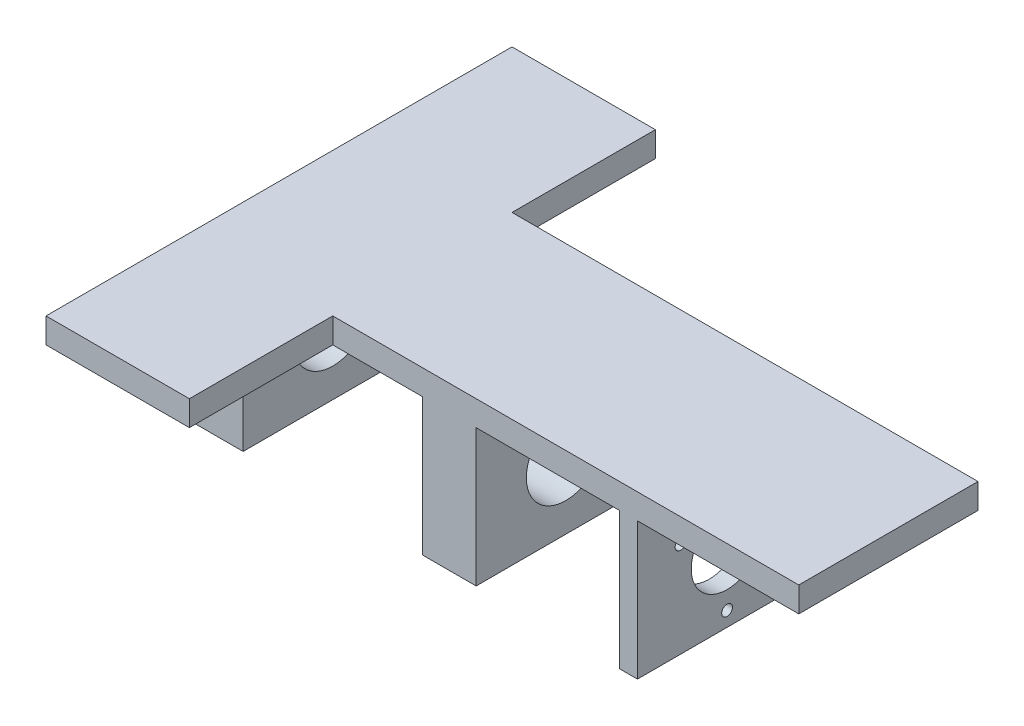
ISO-10303-21;
HEADER;
FILE_DESCRIPTION(('STEP AP214'),'2;1');
FILE_NAME('part.step','',(''),(''),'','','');
FILE_SCHEMA(('AUTOMOTIVE_DESIGN { 1 0 10303 214 1 1 1 1 }'));
ENDSEC;
DATA;
#1=APPLICATION_CONTEXT('core data for automotive mechanical design processes');
#2=APPLICATION_PROTOCOL_DEFINITION('international standard','automotive_design',2000,#1);
#3=PRODUCT_CONTEXT('',#1,'mechanical');
#4=PRODUCT('Part','Part','',(#3));
#5=PRODUCT_RELATED_PRODUCT_CATEGORY('part','',(#4));
#6=PRODUCT_DEFINITION_FORMATION('','',#4);
#7=PRODUCT_DEFINITION_CONTEXT('part definition',#1,'design');
#8=PRODUCT_DEFINITION('design','',#6,#7);
#9=PRODUCT_DEFINITION_SHAPE('','',#8);
#10=(LENGTH_UNIT() NAMED_UNIT(*) SI_UNIT(.MILLI.,.METRE.));
#11=(NAMED_UNIT(*) PLANE_ANGLE_UNIT() SI_UNIT($,.RADIAN.));
#12=(NAMED_UNIT(*) SI_UNIT($,.STERADIAN.) SOLID_ANGLE_UNIT());
#13=UNCERTAINTY_MEASURE_WITH_UNIT(LENGTH_MEASURE(1.E-05),#10,'distance_accuracy_value','');
#14=(GEOMETRIC_REPRESENTATION_CONTEXT(3) GLOBAL_UNCERTAINTY_ASSIGNED_CONTEXT((#13)) GLOBAL_UNIT_ASSIGNED_CONTEXT((#10,
#11,#12)) REPRESENTATION_CONTEXT('',''));
#15=CARTESIAN_POINT('',(0.,0.,0.));
#16=DIRECTION('',(0.,0.,1.));
#17=DIRECTION('',(1.,0.,0.));
#18=AXIS2_PLACEMENT_3D('',#15,#16,#17);
#19=CARTESIAN_POINT('',(0.,0.,40.));
#20=DIRECTION('',(0.,1.,0.));
#21=DIRECTION('',(0.,0.,1.));
#22=AXIS2_PLACEMENT_3D('',#19,#20,#21);
#23=PLANE('',#22);
#24=DIRECTION('',(0.,0.,-1.));
#25=VECTOR('',#24,1.);
#26=CARTESIAN_POINT('',(120.,0.,0.));
#27=LINE('',#26,#25);
#28=CARTESIAN_POINT('',(120.,0.,0.));
#29=VERTEX_POINT('',#28);
#30=CARTESIAN_POINT('',(120.,0.,-50.));
#31=VERTEX_POINT('',#30);
#32=EDGE_CURVE('E48',#29,#31,#27,.T.);
#33=ORIENTED_EDGE('',*,*,#32,.F.);
#34=DIRECTION('',(1.,0.,0.));
#35=VECTOR('',#34,1.);
#36=CARTESIAN_POINT('',(40.,0.,0.));
#37=LINE('',#36,#35);
#38=CARTESIAN_POINT('',(80.,0.,0.));
#39=VERTEX_POINT('',#38);
#40=EDGE_CURVE('E287',#39,#29,#37,.T.);
#41=ORIENTED_EDGE('',*,*,#40,.F.);
#42=DIRECTION('',(0.,0.,1.));
#43=VECTOR('',#42,1.);
#44=CARTESIAN_POINT('',(80.,0.,0.));
#45=LINE('',#44,#43);
#46=CARTESIAN_POINT('',(80.,0.,-50.));
#47=VERTEX_POINT('',#46);
#48=EDGE_CURVE('E192',#47,#39,#45,.T.);
#49=ORIENTED_EDGE('',*,*,#48,.F.);
#50=DIRECTION('',(-1.,0.,0.));
#51=VECTOR('',#50,1.);
#52=CARTESIAN_POINT('',(40.,0.,-50.));
#53=LINE('',#52,#51);
#54=EDGE_CURVE('E293',#31,#47,#53,.T.);
#55=ORIENTED_EDGE('',*,*,#54,.F.);
#56=EDGE_LOOP('',(#33,#41,#49,#55));
#57=FACE_BOUND('',#56,.T.);
#58=ADVANCED_FACE('F31',(#57),#23,.F.);
#59=DIRECTION('',(0.,0.,1.));
#60=VECTOR('',#59,1.);
#61=CARTESIAN_POINT('',(125.,0.,0.));
#62=LINE('',#61,#60);
#63=CARTESIAN_POINT('',(125.,0.,-50.));
#64=VERTEX_POINT('',#63);
#65=CARTESIAN_POINT('',(125.,0.,0.));
#66=VERTEX_POINT('',#65);
#67=EDGE_CURVE('E188',#64,#66,#62,.T.);
#68=ORIENTED_EDGE('',*,*,#67,.F.);
#69=CARTESIAN_POINT('',(170.,0.,-50.));
#70=VERTEX_POINT('',#69);
#71=EDGE_CURVE('E290',#70,#64,#53,.T.);
#72=ORIENTED_EDGE('',*,*,#71,.F.);
#73=DIRECTION('',(0.,0.,-1.));
#74=VECTOR('',#73,1.);
#75=CARTESIAN_POINT('',(170.,0.,0.));
#76=LINE('',#75,#74);
#77=CARTESIAN_POINT('',(170.,0.,0.));
#78=VERTEX_POINT('',#77);
#79=EDGE_CURVE('E286',#78,#70,#76,.T.);
#80=ORIENTED_EDGE('',*,*,#79,.F.);
#81=EDGE_CURVE('E282',#66,#78,#37,.T.);
#82=ORIENTED_EDGE('',*,*,#81,.F.);
#83=EDGE_LOOP('',(#68,#72,#80,#82));
#84=FACE_BOUND('',#83,.T.);
#85=ADVANCED_FACE('F359',(#84),#23,.F.);
#86=DIRECTION('',(0.,0.,-1.));
#87=VECTOR('',#86,1.);
#88=CARTESIAN_POINT('',(65.,0.,0.));
#89=LINE('',#88,#87);
#90=CARTESIAN_POINT('',(65.,0.,0.));
#91=VERTEX_POINT('',#90);
#92=CARTESIAN_POINT('',(65.,0.,-50.));
#93=VERTEX_POINT('',#92);
#94=EDGE_CURVE('E56',#91,#93,#89,.T.);
#95=ORIENTED_EDGE('',*,*,#94,.F.);
#96=CARTESIAN_POINT('',(40.,0.,0.));
#97=VERTEX_POINT('',#96);
#98=EDGE_CURVE('E283',#97,#91,#37,.T.);
#99=ORIENTED_EDGE('',*,*,#98,.F.);
#100=DIRECTION('',(0.,0.,-1.));
#101=VECTOR('',#100,1.);
#102=CARTESIAN_POINT('',(40.,0.,40.));
#103=LINE('',#102,#101);
#104=CARTESIAN_POINT('',(40.,0.,40.));
#105=VERTEX_POINT('',#104);
#106=EDGE_CURVE('E280',#105,#97,#103,.T.);
#107=ORIENTED_EDGE('',*,*,#106,.F.);
#108=DIRECTION('',(1.,0.,0.));
#109=VECTOR('',#108,1.);
#110=CARTESIAN_POINT('',(0.,0.,40.));
#111=LINE('',#110,#109);
#112=CARTESIAN_POINT('',(0.,0.,40.));
#113=VERTEX_POINT('',#112);
#114=EDGE_CURVE('E257',#113,#105,#111,.T.);
#115=ORIENTED_EDGE('',*,*,#114,.F.);
#116=DIRECTION('',(0.,0.,1.));
#117=VECTOR('',#116,1.);
#118=CARTESIAN_POINT('',(0.,0.,0.));
#119=LINE('',#118,#117);
#120=CARTESIAN_POINT('',(0.,0.,0.));
#121=VERTEX_POINT('',#120);
#122=EDGE_CURVE('E298',#121,#113,#119,.T.);
#123=ORIENTED_EDGE('',*,*,#122,.F.);
#124=DIRECTION('',(-1.,0.,0.));
#125=VECTOR('',#124,1.);
#126=CARTESIAN_POINT('',(0.,0.,0.));
#127=LINE('',#126,#125);
#128=CARTESIAN_POINT('',(15.,0.,0.));
#129=VERTEX_POINT('',#128);
#130=EDGE_CURVE('E223',#129,#121,#127,.T.);
#131=ORIENTED_EDGE('',*,*,#130,.F.);
#132=DIRECTION('',(0.,0.,1.));
#133=VECTOR('',#132,1.);
#134=CARTESIAN_POINT('',(15.,0.,0.));
#135=LINE('',#134,#133);
#136=CARTESIAN_POINT('',(15.,0.,-50.));
#137=VERTEX_POINT('',#136);
#138=EDGE_CURVE('E230',#137,#129,#135,.T.);
#139=ORIENTED_EDGE('',*,*,#138,.F.);
#140=DIRECTION('',(1.,0.,0.));
#141=VECTOR('',#140,1.);
#142=CARTESIAN_POINT('',(0.,0.,-50.));
#143=LINE('',#142,#141);
#144=CARTESIAN_POINT('',(0.,0.,-50.));
#145=VERTEX_POINT('',#144);
#146=EDGE_CURVE('E218',#145,#137,#143,.T.);
#147=ORIENTED_EDGE('',*,*,#146,.F.);
#148=CARTESIAN_POINT('',(0.,0.,-90.));
#149=VERTEX_POINT('',#148);
#150=EDGE_CURVE('E263',#149,#145,#119,.T.);
#151=ORIENTED_EDGE('',*,*,#150,.F.);
#152=DIRECTION('',(-1.,0.,0.));
#153=VECTOR('',#152,1.);
#154=CARTESIAN_POINT('',(0.,0.,-90.));
#155=LINE('',#154,#153);
#156=CARTESIAN_POINT('',(40.,0.,-90.));
#157=VERTEX_POINT('',#156);
#158=EDGE_CURVE('E295',#157,#149,#155,.T.);
#159=ORIENTED_EDGE('',*,*,#158,.F.);
#160=DIRECTION('',(0.,0.,-1.));
#161=VECTOR('',#160,1.);
#162=CARTESIAN_POINT('',(40.,0.,-90.));
#163=LINE('',#162,#161);
#164=CARTESIAN_POINT('',(40.,0.,-50.));
#165=VERTEX_POINT('',#164);
#166=EDGE_CURVE('E292',#165,#157,#163,.T.);
#167=ORIENTED_EDGE('',*,*,#166,.F.);
#168=EDGE_CURVE('E289',#93,#165,#53,.T.);
#169=ORIENTED_EDGE('',*,*,#168,.F.);
#170=EDGE_LOOP('',(#95,#99,#107,#115,#123,#131,#139,#147,#151,#159,#167,#169));
#171=FACE_BOUND('',#170,.T.);
#172=ADVANCED_FACE('F335',(#171),#23,.F.);
#173=CARTESIAN_POINT('',(0.,7.,40.));
#174=DIRECTION('',(0.,0.,-1.));
#175=DIRECTION('',(-1.,0.,0.));
#176=AXIS2_PLACEMENT_3D('',#173,#174,#175);
#177=PLANE('',#176);
#178=ORIENTED_EDGE('',*,*,#114,.T.);
#179=DIRECTION('',(0.,-1.,0.));
#180=VECTOR('',#179,1.);
#181=CARTESIAN_POINT('',(40.,7.,40.));
#182=LINE('',#181,#180);
#183=CARTESIAN_POINT('',(40.,7.,40.));
#184=VERTEX_POINT('',#183);
#185=EDGE_CURVE('E40',#184,#105,#182,.T.);
#186=ORIENTED_EDGE('',*,*,#185,.F.);
#187=DIRECTION('',(1.,0.,0.));
#188=VECTOR('',#187,1.);
#189=CARTESIAN_POINT('',(0.,7.,40.));
#190=LINE('',#189,#188);
#191=CARTESIAN_POINT('',(0.,7.,40.));
#192=VERTEX_POINT('',#191);
#193=EDGE_CURVE('E262',#192,#184,#190,.T.);
#194=ORIENTED_EDGE('',*,*,#193,.F.);
#195=DIRECTION('',(0.,-1.,0.));
#196=VECTOR('',#195,1.);
#197=CARTESIAN_POINT('',(0.,7.,40.));
#198=LINE('',#197,#196);
#199=EDGE_CURVE('E11',#192,#113,#198,.T.);
#200=ORIENTED_EDGE('',*,*,#199,.T.);
#201=EDGE_LOOP('',(#178,#186,#194,#200));
#202=FACE_BOUND('',#201,.T.);
#203=ADVANCED_FACE('F33',(#202),#177,.F.);
#204=CARTESIAN_POINT('',(40.,7.,40.));
#205=DIRECTION('',(-1.,0.,0.));
#206=DIRECTION('',(0.,0.,1.));
#207=AXIS2_PLACEMENT_3D('',#204,#205,#206);
#208=PLANE('',#207);
#209=ORIENTED_EDGE('',*,*,#106,.T.);
#210=DIRECTION('',(0.,-1.,0.));
#211=VECTOR('',#210,1.);
#212=CARTESIAN_POINT('',(40.,7.,0.));
#213=LINE('',#212,#211);
#214=CARTESIAN_POINT('',(40.,7.,0.));
#215=VERTEX_POINT('',#214);
#216=EDGE_CURVE('E310',#215,#97,#213,.T.);
#217=ORIENTED_EDGE('',*,*,#216,.F.);
#218=DIRECTION('',(0.,0.,-1.));
#219=VECTOR('',#218,1.);
#220=CARTESIAN_POINT('',(40.,7.,40.));
#221=LINE('',#220,#219);
#222=EDGE_CURVE('E265',#184,#215,#221,.T.);
#223=ORIENTED_EDGE('',*,*,#222,.F.);
#224=ORIENTED_EDGE('',*,*,#185,.T.);
#225=EDGE_LOOP('',(#209,#217,#223,#224));
#226=FACE_BOUND('',#225,.T.);
#227=ADVANCED_FACE('F372',(#226),#208,.F.);
#228=CARTESIAN_POINT('',(40.,7.,0.));
#229=DIRECTION('',(0.,0.,-1.));
#230=DIRECTION('',(-1.,0.,0.));
#231=AXIS2_PLACEMENT_3D('',#228,#229,#230);
#232=PLANE('',#231);
#233=ORIENTED_EDGE('',*,*,#98,.T.);
#234=DIRECTION('',(0.,1.,0.));
#235=VECTOR('',#234,1.);
#236=CARTESIAN_POINT('',(65.,-38.25,0.));
#237=LINE('',#236,#235);
#238=CARTESIAN_POINT('',(65.,-38.25,0.));
#239=VERTEX_POINT('',#238);
#240=EDGE_CURVE('E206',#239,#91,#237,.T.);
#241=ORIENTED_EDGE('',*,*,#240,.F.);
#242=DIRECTION('',(-1.,0.,0.));
#243=VECTOR('',#242,1.);
#244=CARTESIAN_POINT('',(65.,-38.25,0.));
#245=LINE('',#244,#243);
#246=CARTESIAN_POINT('',(80.,-38.25,0.));
#247=VERTEX_POINT('',#246);
#248=EDGE_CURVE('E205',#247,#239,#245,.T.);
#249=ORIENTED_EDGE('',*,*,#248,.F.);
#250=DIRECTION('',(0.,1.,0.));
#251=VECTOR('',#250,1.);
#252=CARTESIAN_POINT('',(80.,-38.25,0.));
#253=LINE('',#252,#251);
#254=EDGE_CURVE('E210',#247,#39,#253,.T.);
#255=ORIENTED_EDGE('',*,*,#254,.T.);
#256=ORIENTED_EDGE('',*,*,#40,.T.);
#257=DIRECTION('',(0.,1.,0.));
#258=VECTOR('',#257,1.);
#259=CARTESIAN_POINT('',(120.,-38.25,0.));
#260=LINE('',#259,#258);
#261=CARTESIAN_POINT('',(120.,-38.25,0.));
#262=VERTEX_POINT('',#261);
#263=EDGE_CURVE('E420',#262,#29,#260,.T.);
#264=ORIENTED_EDGE('',*,*,#263,.F.);
#265=DIRECTION('',(-1.,0.,0.));
#266=VECTOR('',#265,1.);
#267=CARTESIAN_POINT('',(120.,-38.25,0.));
#268=LINE('',#267,#266);
#269=CARTESIAN_POINT('',(125.,-38.25,0.));
#270=VERTEX_POINT('',#269);
#271=EDGE_CURVE('E186',#270,#262,#268,.T.);
#272=ORIENTED_EDGE('',*,*,#271,.F.);
#273=DIRECTION('',(0.,1.,0.));
#274=VECTOR('',#273,1.);
#275=CARTESIAN_POINT('',(125.,-38.25,0.));
#276=LINE('',#275,#274);
#277=EDGE_CURVE('E194',#270,#66,#276,.T.);
#278=ORIENTED_EDGE('',*,*,#277,.T.);
#279=ORIENTED_EDGE('',*,*,#81,.T.);
#280=DIRECTION('',(0.,-1.,0.));
#281=VECTOR('',#280,1.);
#282=CARTESIAN_POINT('',(170.,7.,0.));
#283=LINE('',#282,#281);
#284=CARTESIAN_POINT('',(170.,7.,0.));
#285=VERTEX_POINT('',#284);
#286=EDGE_CURVE('E313',#285,#78,#283,.T.);
#287=ORIENTED_EDGE('',*,*,#286,.F.);
#288=DIRECTION('',(1.,0.,0.));
#289=VECTOR('',#288,1.);
#290=CARTESIAN_POINT('',(40.,7.,0.));
#291=LINE('',#290,#289);
#292=EDGE_CURVE('E267',#215,#285,#291,.T.);
#293=ORIENTED_EDGE('',*,*,#292,.F.);
#294=ORIENTED_EDGE('',*,*,#216,.T.);
#295=EDGE_LOOP('',(#233,#241,#249,#255,#256,#264,#272,#278,#279,#287,#293,#294));
#296=FACE_BOUND('',#295,.T.);
#297=ADVANCED_FACE('F377',(#296),#232,.F.);
#298=CARTESIAN_POINT('',(170.,7.,0.));
#299=DIRECTION('',(-1.,0.,0.));
#300=DIRECTION('',(0.,0.,1.));
#301=AXIS2_PLACEMENT_3D('',#298,#299,#300);
#302=PLANE('',#301);
#303=ORIENTED_EDGE('',*,*,#79,.T.);
#304=DIRECTION('',(0.,-1.,0.));
#305=VECTOR('',#304,1.);
#306=CARTESIAN_POINT('',(170.,7.,-50.));
#307=LINE('',#306,#305);
#308=CARTESIAN_POINT('',(170.,7.,-50.));
#309=VERTEX_POINT('',#308);
#310=EDGE_CURVE('E316',#309,#70,#307,.T.);
#311=ORIENTED_EDGE('',*,*,#310,.F.);
#312=DIRECTION('',(0.,0.,-1.));
#313=VECTOR('',#312,1.);
#314=CARTESIAN_POINT('',(170.,7.,0.));
#315=LINE('',#314,#313);
#316=EDGE_CURVE('E269',#285,#309,#315,.T.);
#317=ORIENTED_EDGE('',*,*,#316,.F.);
#318=ORIENTED_EDGE('',*,*,#286,.T.);
#319=EDGE_LOOP('',(#303,#311,#317,#318));
#320=FACE_BOUND('',#319,.T.);
#321=ADVANCED_FACE('F412',(#320),#302,.F.);
#322=CARTESIAN_POINT('',(40.,7.,-50.));
#323=DIRECTION('',(0.,0.,1.));
#324=DIRECTION('',(1.,0.,0.));
#325=AXIS2_PLACEMENT_3D('',#322,#323,#324);
#326=PLANE('',#325);
#327=ORIENTED_EDGE('',*,*,#71,.T.);
#328=DIRECTION('',(0.,1.,0.));
#329=VECTOR('',#328,1.);
#330=CARTESIAN_POINT('',(125.,-38.25,-50.));
#331=LINE('',#330,#329);
#332=CARTESIAN_POINT('',(125.,-38.25,-50.));
#333=VERTEX_POINT('',#332);
#334=EDGE_CURVE('E177',#333,#64,#331,.T.);
#335=ORIENTED_EDGE('',*,*,#334,.F.);
#336=DIRECTION('',(1.,0.,0.));
#337=VECTOR('',#336,1.);
#338=CARTESIAN_POINT('',(120.,-38.25,-50.));
#339=LINE('',#338,#337);
#340=CARTESIAN_POINT('',(120.,-38.25,-50.));
#341=VERTEX_POINT('',#340);
#342=EDGE_CURVE('E171',#341,#333,#339,.T.);
#343=ORIENTED_EDGE('',*,*,#342,.F.);
#344=DIRECTION('',(0.,1.,0.));
#345=VECTOR('',#344,1.);
#346=CARTESIAN_POINT('',(120.,-38.25,-50.));
#347=LINE('',#346,#345);
#348=EDGE_CURVE('E175',#341,#31,#347,.T.);
#349=ORIENTED_EDGE('',*,*,#348,.T.);
#350=ORIENTED_EDGE('',*,*,#54,.T.);
#351=DIRECTION('',(0.,1.,0.));
#352=VECTOR('',#351,1.);
#353=CARTESIAN_POINT('',(80.,-38.25,-50.));
#354=LINE('',#353,#352);
#355=CARTESIAN_POINT('',(80.,-38.25,-50.));
#356=VERTEX_POINT('',#355);
#357=EDGE_CURVE('E213',#356,#47,#354,.T.);
#358=ORIENTED_EDGE('',*,*,#357,.F.);
#359=DIRECTION('',(1.,0.,0.));
#360=VECTOR('',#359,1.);
#361=CARTESIAN_POINT('',(65.,-38.25,-50.));
#362=LINE('',#361,#360);
#363=CARTESIAN_POINT('',(65.,-38.25,-50.));
#364=VERTEX_POINT('',#363);
#365=EDGE_CURVE('E201',#364,#356,#362,.T.);
#366=ORIENTED_EDGE('',*,*,#365,.F.);
#367=DIRECTION('',(0.,1.,0.));
#368=VECTOR('',#367,1.);
#369=CARTESIAN_POINT('',(65.,-38.25,-50.));
#370=LINE('',#369,#368);
#371=EDGE_CURVE('E216',#364,#93,#370,.T.);
#372=ORIENTED_EDGE('',*,*,#371,.T.);
#373=ORIENTED_EDGE('',*,*,#168,.T.);
#374=DIRECTION('',(0.,-1.,0.));
#375=VECTOR('',#374,1.);
#376=CARTESIAN_POINT('',(40.,7.,-50.));
#377=LINE('',#376,#375);
#378=CARTESIAN_POINT('',(40.,7.,-50.));
#379=VERTEX_POINT('',#378);
#380=EDGE_CURVE('E319',#379,#165,#377,.T.);
#381=ORIENTED_EDGE('',*,*,#380,.F.);
#382=DIRECTION('',(-1.,0.,0.));
#383=VECTOR('',#382,1.);
#384=CARTESIAN_POINT('',(40.,7.,-50.));
#385=LINE('',#384,#383);
#386=EDGE_CURVE('E271',#309,#379,#385,.T.);
#387=ORIENTED_EDGE('',*,*,#386,.F.);
#388=ORIENTED_EDGE('',*,*,#310,.T.);
#389=EDGE_LOOP('',(#327,#335,#343,#349,#350,#358,#366,#372,#373,#381,#387,#388));
#390=FACE_BOUND('',#389,.T.);
#391=ADVANCED_FACE('F174',(#390),#326,.F.);
#392=CARTESIAN_POINT('',(40.,7.,-90.));
#393=DIRECTION('',(-1.,0.,0.));
#394=DIRECTION('',(0.,0.,1.));
#395=AXIS2_PLACEMENT_3D('',#392,#393,#394);
#396=PLANE('',#395);
#397=ORIENTED_EDGE('',*,*,#166,.T.);
#398=DIRECTION('',(0.,-1.,0.));
#399=VECTOR('',#398,1.);
#400=CARTESIAN_POINT('',(40.,7.,-90.));
#401=LINE('',#400,#399);
#402=CARTESIAN_POINT('',(40.,7.,-90.));
#403=VERTEX_POINT('',#402);
#404=EDGE_CURVE('E321',#403,#157,#401,.T.);
#405=ORIENTED_EDGE('',*,*,#404,.F.);
#406=DIRECTION('',(0.,0.,-1.));
#407=VECTOR('',#406,1.);
#408=CARTESIAN_POINT('',(40.,7.,-90.));
#409=LINE('',#408,#407);
#410=EDGE_CURVE('E273',#379,#403,#409,.T.);
#411=ORIENTED_EDGE('',*,*,#410,.F.);
#412=ORIENTED_EDGE('',*,*,#380,.T.);
#413=EDGE_LOOP('',(#397,#405,#411,#412));
#414=FACE_BOUND('',#413,.T.);
#415=ADVANCED_FACE('F397',(#414),#396,.F.);
#416=CARTESIAN_POINT('',(0.,7.,-90.));
#417=DIRECTION('',(0.,0.,1.));
#418=DIRECTION('',(1.,0.,0.));
#419=AXIS2_PLACEMENT_3D('',#416,#417,#418);
#420=PLANE('',#419);
#421=ORIENTED_EDGE('',*,*,#158,.T.);
#422=DIRECTION('',(0.,-1.,0.));
#423=VECTOR('',#422,1.);
#424=CARTESIAN_POINT('',(0.,7.,-90.));
#425=LINE('',#424,#423);
#426=CARTESIAN_POINT('',(0.,7.,-90.));
#427=VERTEX_POINT('',#426);
#428=EDGE_CURVE('E278',#427,#149,#425,.T.);
#429=ORIENTED_EDGE('',*,*,#428,.F.);
#430=DIRECTION('',(-1.,0.,0.));
#431=VECTOR('',#430,1.);
#432=CARTESIAN_POINT('',(0.,7.,-90.));
#433=LINE('',#432,#431);
#434=EDGE_CURVE('E275',#403,#427,#433,.T.);
#435=ORIENTED_EDGE('',*,*,#434,.F.);
#436=ORIENTED_EDGE('',*,*,#404,.T.);
#437=EDGE_LOOP('',(#421,#429,#435,#436));
#438=FACE_BOUND('',#437,.T.);
#439=ADVANCED_FACE('F332',(#438),#420,.F.);
#440=CARTESIAN_POINT('',(0.,7.,0.));
#441=DIRECTION('',(1.,0.,0.));
#442=DIRECTION('',(0.,0.,-1.));
#443=AXIS2_PLACEMENT_3D('',#440,#441,#442);
#444=PLANE('',#443);
#445=CARTESIAN_POINT('',(0.,-19.125,-25.));
#446=DIRECTION('',(-1.,0.,0.));
#447=DIRECTION('',(0.,0.,1.));
#448=AXIS2_PLACEMENT_3D('',#445,#446,#447);
#449=CIRCLE('',#448,11.);
#450=CARTESIAN_POINT('',(0.,-19.125,-14.));
#451=VERTEX_POINT('',#450);
#452=EDGE_CURVE('E423',#451,#451,#449,.T.);
#453=ORIENTED_EDGE('',*,*,#452,.F.);
#454=EDGE_LOOP('',(#453));
#455=FACE_BOUND('',#454,.T.);
#456=ORIENTED_EDGE('',*,*,#150,.T.);
#457=DIRECTION('',(0.,1.,0.));
#458=VECTOR('',#457,1.);
#459=CARTESIAN_POINT('',(0.,-38.25,-50.));
#460=LINE('',#459,#458);
#461=CARTESIAN_POINT('',(0.,-38.25,-50.));
#462=VERTEX_POINT('',#461);
#463=EDGE_CURVE('E252',#462,#145,#460,.T.);
#464=ORIENTED_EDGE('',*,*,#463,.F.);
#465=DIRECTION('',(0.,0.,-1.));
#466=VECTOR('',#465,1.);
#467=CARTESIAN_POINT('',(0.,-38.25,0.));
#468=LINE('',#467,#466);
#469=CARTESIAN_POINT('',(0.,-38.25,0.));
#470=VERTEX_POINT('',#469);
#471=EDGE_CURVE('E219',#470,#462,#468,.T.);
#472=ORIENTED_EDGE('',*,*,#471,.F.);
#473=DIRECTION('',(0.,1.,0.));
#474=VECTOR('',#473,1.);
#475=CARTESIAN_POINT('',(0.,-38.25,0.));
#476=LINE('',#475,#474);
#477=EDGE_CURVE('E229',#470,#121,#476,.T.);
#478=ORIENTED_EDGE('',*,*,#477,.T.);
#479=ORIENTED_EDGE('',*,*,#122,.T.);
#480=ORIENTED_EDGE('',*,*,#199,.F.);
#481=DIRECTION('',(0.,0.,1.));
#482=VECTOR('',#481,1.);
#483=CARTESIAN_POINT('',(0.,7.,0.));
#484=LINE('',#483,#482);
#485=EDGE_CURVE('E259',#427,#192,#484,.T.);
#486=ORIENTED_EDGE('',*,*,#485,.F.);
#487=ORIENTED_EDGE('',*,*,#428,.T.);
#488=EDGE_LOOP('',(#456,#464,#472,#478,#479,#480,#486,#487));
#489=FACE_BOUND('',#488,.T.);
#490=ADVANCED_FACE('F329',(#455,#489),#444,.F.);
#491=CARTESIAN_POINT('',(0.,7.,40.));
#492=DIRECTION('',(0.,1.,0.));
#493=DIRECTION('',(0.,0.,1.));
#494=AXIS2_PLACEMENT_3D('',#491,#492,#493);
#495=PLANE('',#494);
#496=ORIENTED_EDGE('',*,*,#485,.T.);
#497=ORIENTED_EDGE('',*,*,#193,.T.);
#498=ORIENTED_EDGE('',*,*,#222,.T.);
#499=ORIENTED_EDGE('',*,*,#292,.T.);
#500=ORIENTED_EDGE('',*,*,#316,.T.);
#501=ORIENTED_EDGE('',*,*,#386,.T.);
#502=ORIENTED_EDGE('',*,*,#410,.T.);
#503=ORIENTED_EDGE('',*,*,#434,.T.);
#504=EDGE_LOOP('',(#496,#497,#498,#499,#500,#501,#502,#503));
#505=FACE_BOUND('',#504,.T.);
#506=ADVANCED_FACE('F355',(#505),#495,.T.);
#507=CARTESIAN_POINT('',(0.,-38.25,-50.));
#508=DIRECTION('',(0.,0.,1.));
#509=DIRECTION('',(1.,0.,0.));
#510=AXIS2_PLACEMENT_3D('',#507,#508,#509);
#511=PLANE('',#510);
#512=ORIENTED_EDGE('',*,*,#146,.T.);
#513=DIRECTION('',(0.,1.,0.));
#514=VECTOR('',#513,1.);
#515=CARTESIAN_POINT('',(15.,-38.25,-50.));
#516=LINE('',#515,#514);
#517=CARTESIAN_POINT('',(15.,-38.25,-50.));
#518=VERTEX_POINT('',#517);
#519=EDGE_CURVE('E247',#518,#137,#516,.T.);
#520=ORIENTED_EDGE('',*,*,#519,.F.);
#521=DIRECTION('',(1.,0.,0.));
#522=VECTOR('',#521,1.);
#523=CARTESIAN_POINT('',(0.,-38.25,-50.));
#524=LINE('',#523,#522);
#525=EDGE_CURVE('E222',#462,#518,#524,.T.);
#526=ORIENTED_EDGE('',*,*,#525,.F.);
#527=ORIENTED_EDGE('',*,*,#463,.T.);
#528=EDGE_LOOP('',(#512,#520,#526,#527));
#529=FACE_BOUND('',#528,.T.);
#530=ADVANCED_FACE('F341',(#529),#511,.F.);
#531=CARTESIAN_POINT('',(15.,-38.25,0.));
#532=DIRECTION('',(-1.,0.,0.));
#533=DIRECTION('',(0.,0.,1.));
#534=AXIS2_PLACEMENT_3D('',#531,#532,#533);
#535=PLANE('',#534);
#536=CARTESIAN_POINT('',(15.,-19.125,-25.));
#537=DIRECTION('',(-1.,0.,0.));
#538=DIRECTION('',(0.,0.,1.));
#539=AXIS2_PLACEMENT_3D('',#536,#537,#538);
#540=CIRCLE('',#539,11.);
#541=CARTESIAN_POINT('',(15.,-19.125,-14.));
#542=VERTEX_POINT('',#541);
#543=EDGE_CURVE('E416',#542,#542,#540,.T.);
#544=ORIENTED_EDGE('',*,*,#543,.T.);
#545=EDGE_LOOP('',(#544));
#546=FACE_BOUND('',#545,.T.);
#547=ORIENTED_EDGE('',*,*,#138,.T.);
#548=DIRECTION('',(0.,1.,0.));
#549=VECTOR('',#548,1.);
#550=CARTESIAN_POINT('',(15.,-38.25,0.));
#551=LINE('',#550,#549);
#552=CARTESIAN_POINT('',(15.,-38.25,0.));
#553=VERTEX_POINT('',#552);
#554=EDGE_CURVE('E235',#553,#129,#551,.T.);
#555=ORIENTED_EDGE('',*,*,#554,.F.);
#556=DIRECTION('',(0.,0.,1.));
#557=VECTOR('',#556,1.);
#558=CARTESIAN_POINT('',(15.,-38.25,0.));
#559=LINE('',#558,#557);
#560=EDGE_CURVE('E225',#518,#553,#559,.T.);
#561=ORIENTED_EDGE('',*,*,#560,.F.);
#562=ORIENTED_EDGE('',*,*,#519,.T.);
#563=EDGE_LOOP('',(#547,#555,#561,#562));
#564=FACE_BOUND('',#563,.T.);
#565=ADVANCED_FACE('F346',(#546,#564),#535,.F.);
#566=CARTESIAN_POINT('',(0.,-38.25,0.));
#567=DIRECTION('',(0.,0.,-1.));
#568=DIRECTION('',(-1.,0.,0.));
#569=AXIS2_PLACEMENT_3D('',#566,#567,#568);
#570=PLANE('',#569);
#571=ORIENTED_EDGE('',*,*,#130,.T.);
#572=ORIENTED_EDGE('',*,*,#477,.F.);
#573=DIRECTION('',(-1.,0.,0.));
#574=VECTOR('',#573,1.);
#575=CARTESIAN_POINT('',(0.,-38.25,0.));
#576=LINE('',#575,#574);
#577=EDGE_CURVE('E227',#553,#470,#576,.T.);
#578=ORIENTED_EDGE('',*,*,#577,.F.);
#579=ORIENTED_EDGE('',*,*,#554,.T.);
#580=EDGE_LOOP('',(#571,#572,#578,#579));
#581=FACE_BOUND('',#580,.T.);
#582=ADVANCED_FACE('F344',(#581),#570,.F.);
#583=CARTESIAN_POINT('',(0.,-38.25,-50.));
#584=DIRECTION('',(0.,-1.,0.));
#585=DIRECTION('',(0.,0.,-1.));
#586=AXIS2_PLACEMENT_3D('',#583,#584,#585);
#587=PLANE('',#586);
#588=ORIENTED_EDGE('',*,*,#471,.T.);
#589=ORIENTED_EDGE('',*,*,#525,.T.);
#590=ORIENTED_EDGE('',*,*,#560,.T.);
#591=ORIENTED_EDGE('',*,*,#577,.T.);
#592=EDGE_LOOP('',(#588,#589,#590,#591));
#593=FACE_BOUND('',#592,.T.);
#594=ADVANCED_FACE('F343',(#593),#587,.T.);
#595=CARTESIAN_POINT('',(65.,-38.25,0.));
#596=DIRECTION('',(1.,0.,0.));
#597=DIRECTION('',(0.,0.,-1.));
#598=AXIS2_PLACEMENT_3D('',#595,#596,#597);
#599=PLANE('',#598);
#600=CARTESIAN_POINT('',(65.,-19.125,-25.));
#601=DIRECTION('',(-1.,0.,0.));
#602=DIRECTION('',(0.,0.,1.));
#603=AXIS2_PLACEMENT_3D('',#600,#601,#602);
#604=CIRCLE('',#603,11.);
#605=CARTESIAN_POINT('',(65.,-19.125,-14.));
#606=VERTEX_POINT('',#605);
#607=EDGE_CURVE('E428',#606,#606,#604,.T.);
#608=ORIENTED_EDGE('',*,*,#607,.F.);
#609=EDGE_LOOP('',(#608));
#610=FACE_BOUND('',#609,.T.);
#611=ORIENTED_EDGE('',*,*,#94,.T.);
#612=ORIENTED_EDGE('',*,*,#371,.F.);
#613=DIRECTION('',(0.,0.,-1.));
#614=VECTOR('',#613,1.);
#615=CARTESIAN_POINT('',(65.,-38.25,0.));
#616=LINE('',#615,#614);
#617=EDGE_CURVE('E198',#239,#364,#616,.T.);
#618=ORIENTED_EDGE('',*,*,#617,.F.);
#619=ORIENTED_EDGE('',*,*,#240,.T.);
#620=EDGE_LOOP('',(#611,#612,#618,#619));
#621=FACE_BOUND('',#620,.T.);
#622=ADVANCED_FACE('F508',(#610,#621),#599,.F.);
#623=CARTESIAN_POINT('',(80.,-38.25,0.));
#624=DIRECTION('',(-1.,0.,0.));
#625=DIRECTION('',(0.,0.,1.));
#626=AXIS2_PLACEMENT_3D('',#623,#624,#625);
#627=PLANE('',#626);
#628=CARTESIAN_POINT('',(80.,-19.125,-25.));
#629=DIRECTION('',(-1.,0.,0.));
#630=DIRECTION('',(0.,0.,1.));
#631=AXIS2_PLACEMENT_3D('',#628,#629,#630);
#632=CIRCLE('',#631,11.);
#633=CARTESIAN_POINT('',(80.,-19.125,-14.));
#634=VERTEX_POINT('',#633);
#635=EDGE_CURVE('E426',#634,#634,#632,.T.);
#636=ORIENTED_EDGE('',*,*,#635,.T.);
#637=EDGE_LOOP('',(#636));
#638=FACE_BOUND('',#637,.T.);
#639=ORIENTED_EDGE('',*,*,#48,.T.);
#640=ORIENTED_EDGE('',*,*,#254,.F.);
#641=DIRECTION('',(0.,0.,1.));
#642=VECTOR('',#641,1.);
#643=CARTESIAN_POINT('',(80.,-38.25,0.));
#644=LINE('',#643,#642);
#645=EDGE_CURVE('E203',#356,#247,#644,.T.);
#646=ORIENTED_EDGE('',*,*,#645,.F.);
#647=ORIENTED_EDGE('',*,*,#357,.T.);
#648=EDGE_LOOP('',(#639,#640,#646,#647));
#649=FACE_BOUND('',#648,.T.);
#650=ADVANCED_FACE('F402',(#638,#649),#627,.F.);
#651=CARTESIAN_POINT('',(65.,-38.25,-50.));
#652=DIRECTION('',(0.,-1.,0.));
#653=DIRECTION('',(0.,0.,-1.));
#654=AXIS2_PLACEMENT_3D('',#651,#652,#653);
#655=PLANE('',#654);
#656=ORIENTED_EDGE('',*,*,#617,.T.);
#657=ORIENTED_EDGE('',*,*,#365,.T.);
#658=ORIENTED_EDGE('',*,*,#645,.T.);
#659=ORIENTED_EDGE('',*,*,#248,.T.);
#660=EDGE_LOOP('',(#656,#657,#658,#659));
#661=FACE_BOUND('',#660,.T.);
#662=ADVANCED_FACE('F502',(#661),#655,.T.);
#663=CARTESIAN_POINT('',(120.,-38.25,0.));
#664=DIRECTION('',(1.,0.,0.));
#665=DIRECTION('',(0.,0.,-1.));
#666=AXIS2_PLACEMENT_3D('',#663,#664,#665);
#667=PLANE('',#666);
#668=CARTESIAN_POINT('',(120.,-34.125,-25.));
#669=DIRECTION('',(1.,0.,0.));
#670=DIRECTION('',(0.,0.,-1.));
#671=AXIS2_PLACEMENT_3D('',#668,#669,#670);
#672=CIRCLE('',#671,1.5);
#673=CARTESIAN_POINT('',(120.,-34.125,-26.5));
#674=VERTEX_POINT('',#673);
#675=EDGE_CURVE('E449',#674,#674,#672,.T.);
#676=ORIENTED_EDGE('',*,*,#675,.T.);
#677=EDGE_LOOP('',(#676));
#678=FACE_BOUND('',#677,.T.);
#679=CARTESIAN_POINT('',(120.,-11.6249999999999,-37.9903810567666));
#680=DIRECTION('',(1.,0.,0.));
#681=DIRECTION('',(0.,0.,-1.));
#682=AXIS2_PLACEMENT_3D('',#679,#680,#681);
#683=CIRCLE('',#682,1.5);
#684=CARTESIAN_POINT('',(120.,-11.6249999999999,-39.4903810567666));
#685=VERTEX_POINT('',#684);
#686=EDGE_CURVE('E443',#685,#685,#683,.T.);
#687=ORIENTED_EDGE('',*,*,#686,.T.);
#688=EDGE_LOOP('',(#687));
#689=FACE_BOUND('',#688,.T.);
#690=CARTESIAN_POINT('',(120.,-11.6250000000001,-12.0096189432334));
#691=DIRECTION('',(1.,0.,0.));
#692=DIRECTION('',(0.,0.,-1.));
#693=AXIS2_PLACEMENT_3D('',#690,#691,#692);
#694=CIRCLE('',#693,1.5);
#695=CARTESIAN_POINT('',(120.,-11.6250000000001,-13.5096189432334));
#696=VERTEX_POINT('',#695);
#697=EDGE_CURVE('E437',#696,#696,#694,.T.);
#698=ORIENTED_EDGE('',*,*,#697,.T.);
#699=EDGE_LOOP('',(#698));
#700=FACE_BOUND('',#699,.T.);
#701=CARTESIAN_POINT('',(120.,-19.125,-25.));
#702=DIRECTION('',(1.,0.,0.));
#703=DIRECTION('',(0.,0.,-1.));
#704=AXIS2_PLACEMENT_3D('',#701,#702,#703);
#705=CIRCLE('',#704,10.);
#706=CARTESIAN_POINT('',(120.,-19.125,-35.));
#707=VERTEX_POINT('',#706);
#708=EDGE_CURVE('E431',#707,#707,#705,.T.);
#709=ORIENTED_EDGE('',*,*,#708,.T.);
#710=EDGE_LOOP('',(#709));
#711=FACE_BOUND('',#710,.T.);
#712=ORIENTED_EDGE('',*,*,#32,.T.);
#713=ORIENTED_EDGE('',*,*,#348,.F.);
#714=DIRECTION('',(0.,0.,-1.));
#715=VECTOR('',#714,1.);
#716=CARTESIAN_POINT('',(120.,-38.25,0.));
#717=LINE('',#716,#715);
#718=EDGE_CURVE('E181',#262,#341,#717,.T.);
#719=ORIENTED_EDGE('',*,*,#718,.F.);
#720=ORIENTED_EDGE('',*,*,#263,.T.);
#721=EDGE_LOOP('',(#712,#713,#719,#720));
#722=FACE_BOUND('',#721,.T.);
#723=ADVANCED_FACE('F190',(#678,#689,#700,#711,#722),#667,.F.);
#724=CARTESIAN_POINT('',(125.,-38.25,0.));
#725=DIRECTION('',(-1.,0.,0.));
#726=DIRECTION('',(0.,0.,1.));
#727=AXIS2_PLACEMENT_3D('',#724,#725,#726);
#728=PLANE('',#727);
#729=CARTESIAN_POINT('',(125.,-34.125,-25.));
#730=DIRECTION('',(1.,0.,0.));
#731=DIRECTION('',(0.,0.,-1.));
#732=AXIS2_PLACEMENT_3D('',#729,#730,#731);
#733=CIRCLE('',#732,1.5);
#734=CARTESIAN_POINT('',(125.,-34.125,-26.5));
#735=VERTEX_POINT('',#734);
#736=EDGE_CURVE('E452',#735,#735,#733,.T.);
#737=ORIENTED_EDGE('',*,*,#736,.F.);
#738=EDGE_LOOP('',(#737));
#739=FACE_BOUND('',#738,.T.);
#740=CARTESIAN_POINT('',(125.,-11.6249999999999,-37.9903810567666));
#741=DIRECTION('',(1.,0.,0.));
#742=DIRECTION('',(0.,0.,-1.));
#743=AXIS2_PLACEMENT_3D('',#740,#741,#742);
#744=CIRCLE('',#743,1.5);
#745=CARTESIAN_POINT('',(125.,-11.6249999999999,-39.4903810567666));
#746=VERTEX_POINT('',#745);
#747=EDGE_CURVE('E446',#746,#746,#744,.T.);
#748=ORIENTED_EDGE('',*,*,#747,.F.);
#749=EDGE_LOOP('',(#748));
#750=FACE_BOUND('',#749,.T.);
#751=CARTESIAN_POINT('',(125.,-11.6250000000001,-12.0096189432334));
#752=DIRECTION('',(1.,0.,0.));
#753=DIRECTION('',(0.,0.,-1.));
#754=AXIS2_PLACEMENT_3D('',#751,#752,#753);
#755=CIRCLE('',#754,1.5);
#756=CARTESIAN_POINT('',(125.,-11.6250000000001,-13.5096189432334));
#757=VERTEX_POINT('',#756);
#758=EDGE_CURVE('E440',#757,#757,#755,.T.);
#759=ORIENTED_EDGE('',*,*,#758,.F.);
#760=EDGE_LOOP('',(#759));
#761=FACE_BOUND('',#760,.T.);
#762=CARTESIAN_POINT('',(125.,-19.125,-25.));
#763=DIRECTION('',(1.,0.,0.));
#764=DIRECTION('',(0.,0.,-1.));
#765=AXIS2_PLACEMENT_3D('',#762,#763,#764);
#766=CIRCLE('',#765,10.);
#767=CARTESIAN_POINT('',(125.,-19.125,-35.));
#768=VERTEX_POINT('',#767);
#769=EDGE_CURVE('E434',#768,#768,#766,.T.);
#770=ORIENTED_EDGE('',*,*,#769,.F.);
#771=EDGE_LOOP('',(#770));
#772=FACE_BOUND('',#771,.T.);
#773=ORIENTED_EDGE('',*,*,#67,.T.);
#774=ORIENTED_EDGE('',*,*,#277,.F.);
#775=DIRECTION('',(0.,0.,1.));
#776=VECTOR('',#775,1.);
#777=CARTESIAN_POINT('',(125.,-38.25,0.));
#778=LINE('',#777,#776);
#779=EDGE_CURVE('E180',#333,#270,#778,.T.);
#780=ORIENTED_EDGE('',*,*,#779,.F.);
#781=ORIENTED_EDGE('',*,*,#334,.T.);
#782=EDGE_LOOP('',(#773,#774,#780,#781));
#783=FACE_BOUND('',#782,.T.);
#784=ADVANCED_FACE('F467',(#739,#750,#761,#772,#783),#728,.F.);
#785=CARTESIAN_POINT('',(120.,-38.25,-50.));
#786=DIRECTION('',(0.,-1.,0.));
#787=DIRECTION('',(0.,0.,-1.));
#788=AXIS2_PLACEMENT_3D('',#785,#786,#787);
#789=PLANE('',#788);
#790=ORIENTED_EDGE('',*,*,#718,.T.);
#791=ORIENTED_EDGE('',*,*,#342,.T.);
#792=ORIENTED_EDGE('',*,*,#779,.T.);
#793=ORIENTED_EDGE('',*,*,#271,.T.);
#794=EDGE_LOOP('',(#790,#791,#792,#793));
#795=FACE_BOUND('',#794,.T.);
#796=ADVANCED_FACE('F184',(#795),#789,.T.);
#797=CARTESIAN_POINT('',(15.,-19.125,-25.));
#798=DIRECTION('',(-1.,0.,0.));
#799=DIRECTION('',(0.,0.,1.));
#800=AXIS2_PLACEMENT_3D('',#797,#798,#799);
#801=CYLINDRICAL_SURFACE('',#800,11.);
#802=ORIENTED_EDGE('',*,*,#543,.F.);
#803=EDGE_LOOP('',(#802));
#804=FACE_BOUND('',#803,.T.);
#805=ORIENTED_EDGE('',*,*,#452,.T.);
#806=EDGE_LOOP('',(#805));
#807=FACE_BOUND('',#806,.T.);
#808=ADVANCED_FACE('F489',(#804,#807),#801,.F.);
#809=CARTESIAN_POINT('',(80.,-19.125,-25.));
#810=DIRECTION('',(-1.,0.,0.));
#811=DIRECTION('',(0.,0.,1.));
#812=AXIS2_PLACEMENT_3D('',#809,#810,#811);
#813=CYLINDRICAL_SURFACE('',#812,11.);
#814=ORIENTED_EDGE('',*,*,#635,.F.);
#815=EDGE_LOOP('',(#814));
#816=FACE_BOUND('',#815,.T.);
#817=ORIENTED_EDGE('',*,*,#607,.T.);
#818=EDGE_LOOP('',(#817));
#819=FACE_BOUND('',#818,.T.);
#820=ADVANCED_FACE('F480',(#816,#819),#813,.F.);
#821=CARTESIAN_POINT('',(120.,-19.125,-25.));
#822=DIRECTION('',(1.,0.,0.));
#823=DIRECTION('',(0.,0.,-1.));
#824=AXIS2_PLACEMENT_3D('',#821,#822,#823);
#825=CYLINDRICAL_SURFACE('',#824,10.);
#826=ORIENTED_EDGE('',*,*,#708,.F.);
#827=EDGE_LOOP('',(#826));
#828=FACE_BOUND('',#827,.T.);
#829=ORIENTED_EDGE('',*,*,#769,.T.);
#830=EDGE_LOOP('',(#829));
#831=FACE_BOUND('',#830,.T.);
#832=ADVANCED_FACE('F477',(#828,#831),#825,.F.);
#833=CARTESIAN_POINT('',(120.,-11.6250000000001,-12.0096189432334));
#834=DIRECTION('',(1.,0.,0.));
#835=DIRECTION('',(0.,0.,-1.));
#836=AXIS2_PLACEMENT_3D('',#833,#834,#835);
#837=CYLINDRICAL_SURFACE('',#836,1.5);
#838=ORIENTED_EDGE('',*,*,#697,.F.);
#839=EDGE_LOOP('',(#838));
#840=FACE_BOUND('',#839,.T.);
#841=ORIENTED_EDGE('',*,*,#758,.T.);
#842=EDGE_LOOP('',(#841));
#843=FACE_BOUND('',#842,.T.);
#844=ADVANCED_FACE('F479',(#840,#843),#837,.F.);
#845=CARTESIAN_POINT('',(120.,-11.6249999999999,-37.9903810567666));
#846=DIRECTION('',(1.,0.,0.));
#847=DIRECTION('',(0.,0.,-1.));
#848=AXIS2_PLACEMENT_3D('',#845,#846,#847);
#849=CYLINDRICAL_SURFACE('',#848,1.5);
#850=ORIENTED_EDGE('',*,*,#686,.F.);
#851=EDGE_LOOP('',(#850));
#852=FACE_BOUND('',#851,.T.);
#853=ORIENTED_EDGE('',*,*,#747,.T.);
#854=EDGE_LOOP('',(#853));
#855=FACE_BOUND('',#854,.T.);
#856=ADVANCED_FACE('F463',(#852,#855),#849,.F.);
#857=CARTESIAN_POINT('',(120.,-34.125,-25.));
#858=DIRECTION('',(1.,0.,0.));
#859=DIRECTION('',(0.,0.,-1.));
#860=AXIS2_PLACEMENT_3D('',#857,#858,#859);
#861=CYLINDRICAL_SURFACE('',#860,1.5);
#862=ORIENTED_EDGE('',*,*,#675,.F.);
#863=EDGE_LOOP('',(#862));
#864=FACE_BOUND('',#863,.T.);
#865=ORIENTED_EDGE('',*,*,#736,.T.);
#866=EDGE_LOOP('',(#865));
#867=FACE_BOUND('',#866,.T.);
#868=ADVANCED_FACE('F460',(#864,#867),#861,.F.);
#869=CLOSED_SHELL('',(#58,#85,#172,#203,#227,#297,#321,#391,#415,#439,#490,#506,#530,#565,#582,
#594,#622,#650,#662,#723,#784,#796,#808,#820,#832,#844,#856,#868));
#870=MANIFOLD_SOLID_BREP('B2',#869);
#871=ADVANCED_BREP_SHAPE_REPRESENTATION('',(#18,#870),#14);
#872=SHAPE_DEFINITION_REPRESENTATION(#9,#871);
ENDSEC;
END-ISO-10303-21;
